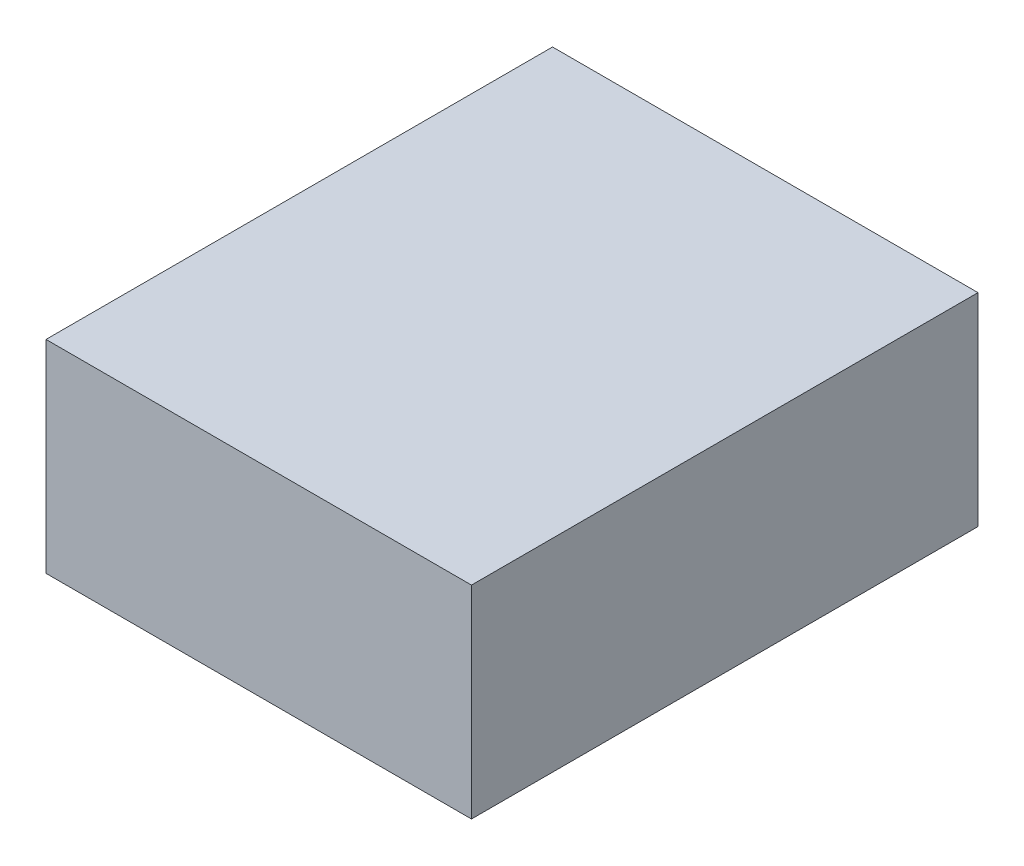
ISO-10303-21;
HEADER;
FILE_DESCRIPTION(('STEP AP214'),'2;1');
FILE_NAME('part.step','',(''),(''),'','','');
FILE_SCHEMA(('AUTOMOTIVE_DESIGN { 1 0 10303 214 1 1 1 1 }'));
ENDSEC;
DATA;
#1=APPLICATION_CONTEXT('core data for automotive mechanical design processes');
#2=APPLICATION_PROTOCOL_DEFINITION('international standard','automotive_design',2000,#1);
#3=PRODUCT_CONTEXT('',#1,'mechanical');
#4=PRODUCT('Part','Part','',(#3));
#5=PRODUCT_RELATED_PRODUCT_CATEGORY('part','',(#4));
#6=PRODUCT_DEFINITION_FORMATION('','',#4);
#7=PRODUCT_DEFINITION_CONTEXT('part definition',#1,'design');
#8=PRODUCT_DEFINITION('design','',#6,#7);
#9=PRODUCT_DEFINITION_SHAPE('','',#8);
#10=(LENGTH_UNIT() NAMED_UNIT(*) SI_UNIT(.MILLI.,.METRE.));
#11=(NAMED_UNIT(*) PLANE_ANGLE_UNIT() SI_UNIT($,.RADIAN.));
#12=(NAMED_UNIT(*) SI_UNIT($,.STERADIAN.) SOLID_ANGLE_UNIT());
#13=UNCERTAINTY_MEASURE_WITH_UNIT(LENGTH_MEASURE(1.E-05),#10,'distance_accuracy_value','');
#14=(GEOMETRIC_REPRESENTATION_CONTEXT(3) GLOBAL_UNCERTAINTY_ASSIGNED_CONTEXT((#13)) GLOBAL_UNIT_ASSIGNED_CONTEXT((#10,
#11,#12)) REPRESENTATION_CONTEXT('',''));
#15=CARTESIAN_POINT('',(0.,0.,0.));
#16=DIRECTION('',(0.,0.,1.));
#17=DIRECTION('',(1.,0.,0.));
#18=AXIS2_PLACEMENT_3D('',#15,#16,#17);
#19=CARTESIAN_POINT('',(-0.00279074959534224,0.5,0.));
#20=DIRECTION('',(1.,0.,0.));
#21=DIRECTION('',(0.,0.,-1.));
#22=AXIS2_PLACEMENT_3D('',#19,#20,#21);
#23=PLANE('',#22);
#24=DIRECTION('',(0.,0.,1.));
#25=VECTOR('',#24,1.);
#26=CARTESIAN_POINT('',(-0.00279074959534224,0.,0.));
#27=LINE('',#26,#25);
#28=CARTESIAN_POINT('',(-0.00279074959534224,0.,-1.25));
#29=VERTEX_POINT('',#28);
#30=CARTESIAN_POINT('',(-0.00279074959534224,0.,0.));
#31=VERTEX_POINT('',#30);
#32=EDGE_CURVE('E111',#29,#31,#27,.T.);
#33=ORIENTED_EDGE('',*,*,#32,.T.);
#34=DIRECTION('',(0.,-1.,0.));
#35=VECTOR('',#34,1.);
#36=CARTESIAN_POINT('',(-0.00279074959534224,0.5,0.));
#37=LINE('',#36,#35);
#38=CARTESIAN_POINT('',(-0.00279074959534224,0.5,0.));
#39=VERTEX_POINT('',#38);
#40=EDGE_CURVE('E11',#39,#31,#37,.T.);
#41=ORIENTED_EDGE('',*,*,#40,.F.);
#42=DIRECTION('',(0.,0.,1.));
#43=VECTOR('',#42,1.);
#44=CARTESIAN_POINT('',(-0.00279074959534224,0.5,0.));
#45=LINE('',#44,#43);
#46=CARTESIAN_POINT('',(-0.00279074959534224,0.5,-1.25));
#47=VERTEX_POINT('',#46);
#48=EDGE_CURVE('E95',#47,#39,#45,.T.);
#49=ORIENTED_EDGE('',*,*,#48,.F.);
#50=DIRECTION('',(0.,-1.,0.));
#51=VECTOR('',#50,1.);
#52=CARTESIAN_POINT('',(-0.00279074959534224,0.5,-1.25));
#53=LINE('',#52,#51);
#54=EDGE_CURVE('E107',#47,#29,#53,.T.);
#55=ORIENTED_EDGE('',*,*,#54,.T.);
#56=EDGE_LOOP('',(#33,#41,#49,#55));
#57=FACE_BOUND('',#56,.T.);
#58=ADVANCED_FACE('F43',(#57),#23,.F.);
#59=CARTESIAN_POINT('',(-0.00279074959534224,0.5,0.));
#60=DIRECTION('',(0.,0.,-1.));
#61=DIRECTION('',(-1.,0.,0.));
#62=AXIS2_PLACEMENT_3D('',#59,#60,#61);
#63=PLANE('',#62);
#64=DIRECTION('',(1.,0.,0.));
#65=VECTOR('',#64,1.);
#66=CARTESIAN_POINT('',(-0.00279074959534224,0.,0.));
#67=LINE('',#66,#65);
#68=CARTESIAN_POINT('',(1.04720925040466,0.,0.));
#69=VERTEX_POINT('',#68);
#70=EDGE_CURVE('E100',#31,#69,#67,.T.);
#71=ORIENTED_EDGE('',*,*,#70,.T.);
#72=DIRECTION('',(0.,-1.,0.));
#73=VECTOR('',#72,1.);
#74=CARTESIAN_POINT('',(1.04720925040466,0.5,0.));
#75=LINE('',#74,#73);
#76=CARTESIAN_POINT('',(1.04720925040466,0.5,0.));
#77=VERTEX_POINT('',#76);
#78=EDGE_CURVE('E52',#77,#69,#75,.T.);
#79=ORIENTED_EDGE('',*,*,#78,.F.);
#80=DIRECTION('',(1.,0.,0.));
#81=VECTOR('',#80,1.);
#82=CARTESIAN_POINT('',(-0.00279074959534224,0.5,0.));
#83=LINE('',#82,#81);
#84=EDGE_CURVE('E90',#39,#77,#83,.T.);
#85=ORIENTED_EDGE('',*,*,#84,.F.);
#86=ORIENTED_EDGE('',*,*,#40,.T.);
#87=EDGE_LOOP('',(#71,#79,#85,#86));
#88=FACE_BOUND('',#87,.T.);
#89=ADVANCED_FACE('F99',(#88),#63,.F.);
#90=CARTESIAN_POINT('',(1.04720925040466,0.5,0.));
#91=DIRECTION('',(-1.,0.,0.));
#92=DIRECTION('',(0.,0.,1.));
#93=AXIS2_PLACEMENT_3D('',#90,#91,#92);
#94=PLANE('',#93);
#95=DIRECTION('',(0.,0.,-1.));
#96=VECTOR('',#95,1.);
#97=CARTESIAN_POINT('',(1.04720925040466,0.,0.));
#98=LINE('',#97,#96);
#99=CARTESIAN_POINT('',(1.04720925040466,0.,-1.25));
#100=VERTEX_POINT('',#99);
#101=EDGE_CURVE('E77',#69,#100,#98,.T.);
#102=ORIENTED_EDGE('',*,*,#101,.T.);
#103=DIRECTION('',(0.,-1.,0.));
#104=VECTOR('',#103,1.);
#105=CARTESIAN_POINT('',(1.04720925040466,0.5,-1.25));
#106=LINE('',#105,#104);
#107=CARTESIAN_POINT('',(1.04720925040466,0.5,-1.25));
#108=VERTEX_POINT('',#107);
#109=EDGE_CURVE('E102',#108,#100,#106,.T.);
#110=ORIENTED_EDGE('',*,*,#109,.F.);
#111=DIRECTION('',(0.,0.,-1.));
#112=VECTOR('',#111,1.);
#113=CARTESIAN_POINT('',(1.04720925040466,0.5,0.));
#114=LINE('',#113,#112);
#115=EDGE_CURVE('E93',#77,#108,#114,.T.);
#116=ORIENTED_EDGE('',*,*,#115,.F.);
#117=ORIENTED_EDGE('',*,*,#78,.T.);
#118=EDGE_LOOP('',(#102,#110,#116,#117));
#119=FACE_BOUND('',#118,.T.);
#120=ADVANCED_FACE('F103',(#119),#94,.F.);
#121=CARTESIAN_POINT('',(-0.00279074959534224,0.5,-1.25));
#122=DIRECTION('',(0.,0.,1.));
#123=DIRECTION('',(1.,0.,0.));
#124=AXIS2_PLACEMENT_3D('',#121,#122,#123);
#125=PLANE('',#124);
#126=DIRECTION('',(-1.,0.,0.));
#127=VECTOR('',#126,1.);
#128=CARTESIAN_POINT('',(-0.00279074959534224,0.,-1.25));
#129=LINE('',#128,#127);
#130=EDGE_CURVE('E83',#100,#29,#129,.T.);
#131=ORIENTED_EDGE('',*,*,#130,.T.);
#132=ORIENTED_EDGE('',*,*,#54,.F.);
#133=DIRECTION('',(-1.,0.,0.));
#134=VECTOR('',#133,1.);
#135=CARTESIAN_POINT('',(-0.00279074959534224,0.5,-1.25));
#136=LINE('',#135,#134);
#137=EDGE_CURVE('E60',#108,#47,#136,.T.);
#138=ORIENTED_EDGE('',*,*,#137,.F.);
#139=ORIENTED_EDGE('',*,*,#109,.T.);
#140=EDGE_LOOP('',(#131,#132,#138,#139));
#141=FACE_BOUND('',#140,.T.);
#142=ADVANCED_FACE('F124',(#141),#125,.F.);
#143=CARTESIAN_POINT('',(0.,0.5,0.));
#144=DIRECTION('',(0.,-1.,0.));
#145=DIRECTION('',(0.,0.,-1.));
#146=AXIS2_PLACEMENT_3D('',#143,#144,#145);
#147=PLANE('',#146);
#148=ORIENTED_EDGE('',*,*,#48,.T.);
#149=ORIENTED_EDGE('',*,*,#84,.T.);
#150=ORIENTED_EDGE('',*,*,#115,.T.);
#151=ORIENTED_EDGE('',*,*,#137,.T.);
#152=EDGE_LOOP('',(#148,#149,#150,#151));
#153=FACE_BOUND('',#152,.T.);
#154=ADVANCED_FACE('F91',(#153),#147,.F.);
#155=CARTESIAN_POINT('',(0.,0.,0.));
#156=DIRECTION('',(0.,-1.,0.));
#157=DIRECTION('',(0.,0.,-1.));
#158=AXIS2_PLACEMENT_3D('',#155,#156,#157);
#159=PLANE('',#158);
#160=ORIENTED_EDGE('',*,*,#32,.F.);
#161=ORIENTED_EDGE('',*,*,#130,.F.);
#162=ORIENTED_EDGE('',*,*,#101,.F.);
#163=ORIENTED_EDGE('',*,*,#70,.F.);
#164=EDGE_LOOP('',(#160,#161,#162,#163));
#165=FACE_BOUND('',#164,.T.);
#166=ADVANCED_FACE('F127',(#165),#159,.T.);
#167=CLOSED_SHELL('',(#58,#89,#120,#142,#154,#166));
#168=MANIFOLD_SOLID_BREP('B2',#167);
#169=ADVANCED_BREP_SHAPE_REPRESENTATION('',(#18,#168),#14);
#170=SHAPE_DEFINITION_REPRESENTATION(#9,#169);
ENDSEC;
END-ISO-10303-21;
